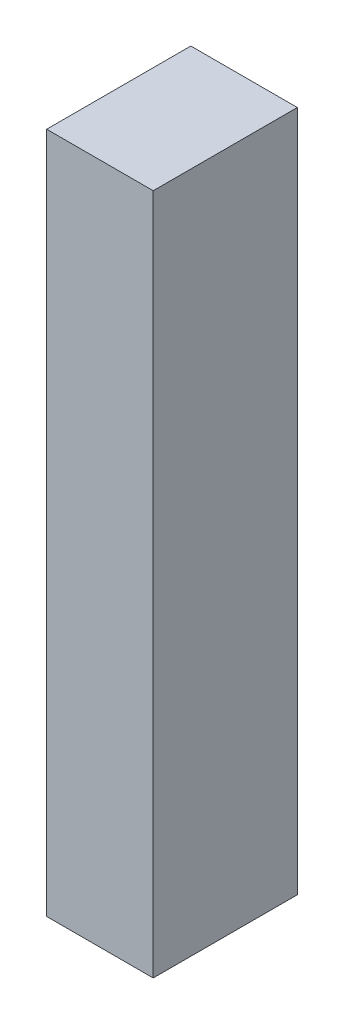
ISO-10303-21;
HEADER;
FILE_DESCRIPTION(('STEP AP214'),'2;1');
FILE_NAME('part.step','',(''),(''),'','','');
FILE_SCHEMA(('AUTOMOTIVE_DESIGN { 1 0 10303 214 1 1 1 1 }'));
ENDSEC;
DATA;
#1=APPLICATION_CONTEXT('core data for automotive mechanical design processes');
#2=APPLICATION_PROTOCOL_DEFINITION('international standard','automotive_design',2000,#1);
#3=PRODUCT_CONTEXT('',#1,'mechanical');
#4=PRODUCT('Part','Part','',(#3));
#5=PRODUCT_RELATED_PRODUCT_CATEGORY('part','',(#4));
#6=PRODUCT_DEFINITION_FORMATION('','',#4);
#7=PRODUCT_DEFINITION_CONTEXT('part definition',#1,'design');
#8=PRODUCT_DEFINITION('design','',#6,#7);
#9=PRODUCT_DEFINITION_SHAPE('','',#8);
#10=(LENGTH_UNIT() NAMED_UNIT(*) SI_UNIT(.MILLI.,.METRE.));
#11=(NAMED_UNIT(*) PLANE_ANGLE_UNIT() SI_UNIT($,.RADIAN.));
#12=(NAMED_UNIT(*) SI_UNIT($,.STERADIAN.) SOLID_ANGLE_UNIT());
#13=UNCERTAINTY_MEASURE_WITH_UNIT(LENGTH_MEASURE(1.E-05),#10,'distance_accuracy_value','');
#14=(GEOMETRIC_REPRESENTATION_CONTEXT(3) GLOBAL_UNCERTAINTY_ASSIGNED_CONTEXT((#13)) GLOBAL_UNIT_ASSIGNED_CONTEXT((#10,
#11,#12)) REPRESENTATION_CONTEXT('',''));
#15=CARTESIAN_POINT('',(0.,0.,0.));
#16=DIRECTION('',(0.,0.,1.));
#17=DIRECTION('',(1.,0.,0.));
#18=AXIS2_PLACEMENT_3D('',#15,#16,#17);
#19=CARTESIAN_POINT('',(-0.42500042,-2.71999964,0.));
#20=DIRECTION('',(-1.,0.,0.));
#21=DIRECTION('',(0.,0.,1.));
#22=AXIS2_PLACEMENT_3D('',#19,#20,#21);
#23=PLANE('',#22);
#24=DIRECTION('',(0.,0.,1.));
#25=VECTOR('',#24,1.);
#26=CARTESIAN_POINT('',(-0.42500042,2.71999964,0.));
#27=LINE('',#26,#25);
#28=CARTESIAN_POINT('',(-0.42500042,2.71999964,0.));
#29=VERTEX_POINT('',#28);
#30=CARTESIAN_POINT('',(-0.42500042,2.71999964,1.15000024));
#31=VERTEX_POINT('',#30);
#32=EDGE_CURVE('E19',#29,#31,#27,.T.);
#33=ORIENTED_EDGE('',*,*,#32,.F.);
#34=DIRECTION('',(0.,1.,0.));
#35=VECTOR('',#34,1.);
#36=CARTESIAN_POINT('',(-0.42500042,2.71999964,0.));
#37=LINE('',#36,#35);
#38=CARTESIAN_POINT('',(-0.42500042,-2.71999964,0.));
#39=VERTEX_POINT('',#38);
#40=EDGE_CURVE('E79',#29,#39,#37,.F.);
#41=ORIENTED_EDGE('',*,*,#40,.T.);
#42=DIRECTION('',(0.,0.,-1.));
#43=VECTOR('',#42,1.);
#44=CARTESIAN_POINT('',(-0.42500042,-2.71999964,0.));
#45=LINE('',#44,#43);
#46=CARTESIAN_POINT('',(-0.42500042,-2.71999964,1.15000024));
#47=VERTEX_POINT('',#46);
#48=EDGE_CURVE('E67',#47,#39,#45,.T.);
#49=ORIENTED_EDGE('',*,*,#48,.F.);
#50=DIRECTION('',(0.,1.,0.));
#51=VECTOR('',#50,1.);
#52=CARTESIAN_POINT('',(-0.42500042,2.71999964,1.15000024));
#53=LINE('',#52,#51);
#54=EDGE_CURVE('E55',#31,#47,#53,.F.);
#55=ORIENTED_EDGE('',*,*,#54,.F.);
#56=EDGE_LOOP('',(#33,#41,#49,#55));
#57=FACE_BOUND('',#56,.T.);
#58=ADVANCED_FACE('F16',(#57),#23,.T.);
#59=CARTESIAN_POINT('',(-0.42500042,2.71999964,0.));
#60=DIRECTION('',(0.,1.,0.));
#61=DIRECTION('',(0.,0.,1.));
#62=AXIS2_PLACEMENT_3D('',#59,#60,#61);
#63=PLANE('',#62);
#64=DIRECTION('',(0.,0.,-1.));
#65=VECTOR('',#64,1.);
#66=CARTESIAN_POINT('',(0.42500042,2.71999964,0.));
#67=LINE('',#66,#65);
#68=CARTESIAN_POINT('',(0.42500042,2.71999964,0.));
#69=VERTEX_POINT('',#68);
#70=CARTESIAN_POINT('',(0.42500042,2.71999964,1.15000024));
#71=VERTEX_POINT('',#70);
#72=EDGE_CURVE('E82',#69,#71,#67,.F.);
#73=ORIENTED_EDGE('',*,*,#72,.F.);
#74=DIRECTION('',(1.,0.,0.));
#75=VECTOR('',#74,1.);
#76=CARTESIAN_POINT('',(0.42500042,2.71999964,0.));
#77=LINE('',#76,#75);
#78=EDGE_CURVE('E64',#69,#29,#77,.F.);
#79=ORIENTED_EDGE('',*,*,#78,.T.);
#80=ORIENTED_EDGE('',*,*,#32,.T.);
#81=DIRECTION('',(1.,0.,0.));
#82=VECTOR('',#81,1.);
#83=CARTESIAN_POINT('',(0.42500042,2.71999964,1.15000024));
#84=LINE('',#83,#82);
#85=EDGE_CURVE('E61',#71,#31,#84,.F.);
#86=ORIENTED_EDGE('',*,*,#85,.F.);
#87=EDGE_LOOP('',(#73,#79,#80,#86));
#88=FACE_BOUND('',#87,.T.);
#89=ADVANCED_FACE('F60',(#88),#63,.T.);
#90=CARTESIAN_POINT('',(0.42500042,2.71999964,1.15000024));
#91=DIRECTION('',(0.,0.,1.));
#92=DIRECTION('',(1.,0.,0.));
#93=AXIS2_PLACEMENT_3D('',#90,#91,#92);
#94=PLANE('',#93);
#95=DIRECTION('',(1.,0.,0.));
#96=VECTOR('',#95,1.);
#97=CARTESIAN_POINT('',(0.42500042,-2.71999964,1.15000024));
#98=LINE('',#97,#96);
#99=CARTESIAN_POINT('',(0.42500042,-2.71999964,1.15000024));
#100=VERTEX_POINT('',#99);
#101=EDGE_CURVE('E69',#100,#47,#98,.F.);
#102=ORIENTED_EDGE('',*,*,#101,.F.);
#103=DIRECTION('',(0.,1.,0.));
#104=VECTOR('',#103,1.);
#105=CARTESIAN_POINT('',(0.42500042,2.71999964,1.15000024));
#106=LINE('',#105,#104);
#107=EDGE_CURVE('E73',#71,#100,#106,.F.);
#108=ORIENTED_EDGE('',*,*,#107,.F.);
#109=ORIENTED_EDGE('',*,*,#85,.T.);
#110=ORIENTED_EDGE('',*,*,#54,.T.);
#111=EDGE_LOOP('',(#102,#108,#109,#110));
#112=FACE_BOUND('',#111,.T.);
#113=ADVANCED_FACE('F71',(#112),#94,.T.);
#114=CARTESIAN_POINT('',(0.42500042,-2.71999964,0.));
#115=DIRECTION('',(0.,-1.,0.));
#116=DIRECTION('',(0.,0.,-1.));
#117=AXIS2_PLACEMENT_3D('',#114,#115,#116);
#118=PLANE('',#117);
#119=ORIENTED_EDGE('',*,*,#48,.T.);
#120=DIRECTION('',(1.,0.,0.));
#121=VECTOR('',#120,1.);
#122=CARTESIAN_POINT('',(0.42500042,-2.71999964,0.));
#123=LINE('',#122,#121);
#124=CARTESIAN_POINT('',(0.42500042,-2.71999964,0.));
#125=VERTEX_POINT('',#124);
#126=EDGE_CURVE('E34',#39,#125,#123,.T.);
#127=ORIENTED_EDGE('',*,*,#126,.T.);
#128=DIRECTION('',(0.,0.,-1.));
#129=VECTOR('',#128,1.);
#130=CARTESIAN_POINT('',(0.42500042,-2.71999964,0.));
#131=LINE('',#130,#129);
#132=EDGE_CURVE('E25',#100,#125,#131,.T.);
#133=ORIENTED_EDGE('',*,*,#132,.F.);
#134=ORIENTED_EDGE('',*,*,#101,.T.);
#135=EDGE_LOOP('',(#119,#127,#133,#134));
#136=FACE_BOUND('',#135,.T.);
#137=ADVANCED_FACE('F88',(#136),#118,.T.);
#138=CARTESIAN_POINT('',(0.42500042,2.71999964,0.));
#139=DIRECTION('',(0.,0.,1.));
#140=DIRECTION('',(1.,0.,0.));
#141=AXIS2_PLACEMENT_3D('',#138,#139,#140);
#142=PLANE('',#141);
#143=ORIENTED_EDGE('',*,*,#126,.F.);
#144=ORIENTED_EDGE('',*,*,#40,.F.);
#145=ORIENTED_EDGE('',*,*,#78,.F.);
#146=DIRECTION('',(0.,1.,0.));
#147=VECTOR('',#146,1.);
#148=CARTESIAN_POINT('',(0.42500042,2.71999964,0.));
#149=LINE('',#148,#147);
#150=EDGE_CURVE('E11',#125,#69,#149,.T.);
#151=ORIENTED_EDGE('',*,*,#150,.F.);
#152=EDGE_LOOP('',(#143,#144,#145,#151));
#153=FACE_BOUND('',#152,.T.);
#154=ADVANCED_FACE('F90',(#153),#142,.F.);
#155=CARTESIAN_POINT('',(0.42500042,2.71999964,0.));
#156=DIRECTION('',(1.,0.,0.));
#157=DIRECTION('',(0.,0.,-1.));
#158=AXIS2_PLACEMENT_3D('',#155,#156,#157);
#159=PLANE('',#158);
#160=ORIENTED_EDGE('',*,*,#132,.T.);
#161=ORIENTED_EDGE('',*,*,#150,.T.);
#162=ORIENTED_EDGE('',*,*,#72,.T.);
#163=ORIENTED_EDGE('',*,*,#107,.T.);
#164=EDGE_LOOP('',(#160,#161,#162,#163));
#165=FACE_BOUND('',#164,.T.);
#166=ADVANCED_FACE('F87',(#165),#159,.T.);
#167=CLOSED_SHELL('',(#58,#89,#113,#137,#154,#166));
#168=MANIFOLD_SOLID_BREP('B1',#167);
#169=ADVANCED_BREP_SHAPE_REPRESENTATION('',(#18,#168),#14);
#170=SHAPE_DEFINITION_REPRESENTATION(#9,#169);
ENDSEC;
END-ISO-10303-21;
